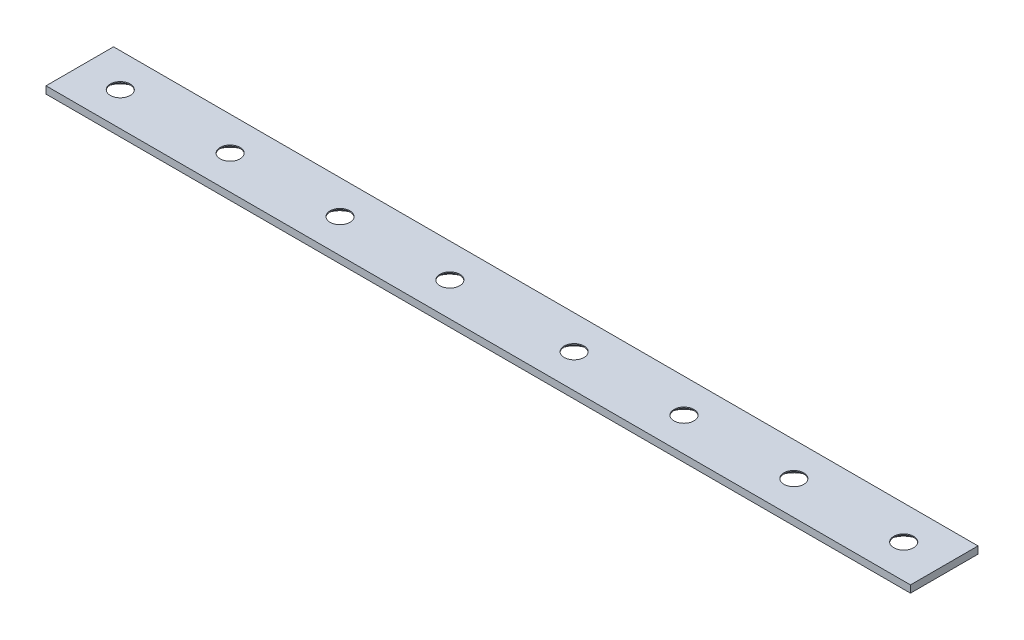
ISO-10303-21;
HEADER;
FILE_DESCRIPTION(('STEP AP214'),'2;1');
FILE_NAME('part.step','',(''),(''),'','','');
FILE_SCHEMA(('AUTOMOTIVE_DESIGN { 1 0 10303 214 1 1 1 1 }'));
ENDSEC;
DATA;
#1=APPLICATION_CONTEXT('core data for automotive mechanical design processes');
#2=APPLICATION_PROTOCOL_DEFINITION('international standard','automotive_design',2000,#1);
#3=PRODUCT_CONTEXT('',#1,'mechanical');
#4=PRODUCT('Part','Part','',(#3));
#5=PRODUCT_RELATED_PRODUCT_CATEGORY('part','',(#4));
#6=PRODUCT_DEFINITION_FORMATION('','',#4);
#7=PRODUCT_DEFINITION_CONTEXT('part definition',#1,'design');
#8=PRODUCT_DEFINITION('design','',#6,#7);
#9=PRODUCT_DEFINITION_SHAPE('','',#8);
#10=(LENGTH_UNIT() NAMED_UNIT(*) SI_UNIT(.MILLI.,.METRE.));
#11=(NAMED_UNIT(*) PLANE_ANGLE_UNIT() SI_UNIT($,.RADIAN.));
#12=(NAMED_UNIT(*) SI_UNIT($,.STERADIAN.) SOLID_ANGLE_UNIT());
#13=UNCERTAINTY_MEASURE_WITH_UNIT(LENGTH_MEASURE(1.E-05),#10,'distance_accuracy_value','');
#14=(GEOMETRIC_REPRESENTATION_CONTEXT(3) GLOBAL_UNCERTAINTY_ASSIGNED_CONTEXT((#13)) GLOBAL_UNIT_ASSIGNED_CONTEXT((#10,
#11,#12)) REPRESENTATION_CONTEXT('',''));
#15=CARTESIAN_POINT('',(0.,0.,0.));
#16=DIRECTION('',(0.,0.,1.));
#17=DIRECTION('',(1.,0.,0.));
#18=AXIS2_PLACEMENT_3D('',#15,#16,#17);
#19=CARTESIAN_POINT('',(0.,2.032,0.));
#20=DIRECTION('',(-1.,0.,0.));
#21=DIRECTION('',(0.,0.,1.));
#22=AXIS2_PLACEMENT_3D('',#19,#20,#21);
#23=PLANE('',#22);
#24=DIRECTION('',(0.,0.,-1.));
#25=VECTOR('',#24,1.);
#26=CARTESIAN_POINT('',(0.,0.,0.));
#27=LINE('',#26,#25);
#28=CARTESIAN_POINT('',(0.,0.,0.));
#29=VERTEX_POINT('',#28);
#30=CARTESIAN_POINT('',(0.,0.,-19.05));
#31=VERTEX_POINT('',#30);
#32=EDGE_CURVE('E102',#29,#31,#27,.T.);
#33=ORIENTED_EDGE('',*,*,#32,.F.);
#34=DIRECTION('',(0.,-1.,0.));
#35=VECTOR('',#34,1.);
#36=CARTESIAN_POINT('',(0.,2.032,0.));
#37=LINE('',#36,#35);
#38=CARTESIAN_POINT('',(0.,2.032,0.));
#39=VERTEX_POINT('',#38);
#40=EDGE_CURVE('E11',#39,#29,#37,.T.);
#41=ORIENTED_EDGE('',*,*,#40,.F.);
#42=DIRECTION('',(0.,0.,-1.));
#43=VECTOR('',#42,1.);
#44=CARTESIAN_POINT('',(0.,2.032,0.));
#45=LINE('',#44,#43);
#46=CARTESIAN_POINT('',(0.,2.032,-19.05));
#47=VERTEX_POINT('',#46);
#48=EDGE_CURVE('E96',#39,#47,#45,.T.);
#49=ORIENTED_EDGE('',*,*,#48,.T.);
#50=DIRECTION('',(0.,-1.,0.));
#51=VECTOR('',#50,1.);
#52=CARTESIAN_POINT('',(0.,2.032,-19.05));
#53=LINE('',#52,#51);
#54=EDGE_CURVE('E39',#47,#31,#53,.T.);
#55=ORIENTED_EDGE('',*,*,#54,.T.);
#56=EDGE_LOOP('',(#33,#41,#49,#55));
#57=FACE_BOUND('',#56,.T.);
#58=ADVANCED_FACE('F36',(#57),#23,.T.);
#59=CARTESIAN_POINT('',(0.,2.032,0.));
#60=DIRECTION('',(0.,0.,-1.));
#61=DIRECTION('',(-1.,0.,0.));
#62=AXIS2_PLACEMENT_3D('',#59,#60,#61);
#63=PLANE('',#62);
#64=DIRECTION('',(1.,0.,0.));
#65=VECTOR('',#64,1.);
#66=CARTESIAN_POINT('',(0.,0.,0.));
#67=LINE('',#66,#65);
#68=CARTESIAN_POINT('',(243.84,0.,0.));
#69=VERTEX_POINT('',#68);
#70=EDGE_CURVE('E69',#29,#69,#67,.T.);
#71=ORIENTED_EDGE('',*,*,#70,.T.);
#72=DIRECTION('',(0.,-1.,0.));
#73=VECTOR('',#72,1.);
#74=CARTESIAN_POINT('',(243.84,2.032,0.));
#75=LINE('',#74,#73);
#76=CARTESIAN_POINT('',(243.84,2.032,0.));
#77=VERTEX_POINT('',#76);
#78=EDGE_CURVE('E45',#77,#69,#75,.T.);
#79=ORIENTED_EDGE('',*,*,#78,.F.);
#80=DIRECTION('',(1.,0.,0.));
#81=VECTOR('',#80,1.);
#82=CARTESIAN_POINT('',(0.,2.032,0.));
#83=LINE('',#82,#81);
#84=EDGE_CURVE('E86',#39,#77,#83,.T.);
#85=ORIENTED_EDGE('',*,*,#84,.F.);
#86=ORIENTED_EDGE('',*,*,#40,.T.);
#87=EDGE_LOOP('',(#71,#79,#85,#86));
#88=FACE_BOUND('',#87,.T.);
#89=ADVANCED_FACE('F113',(#88),#63,.F.);
#90=CARTESIAN_POINT('',(243.84,2.032,0.));
#91=DIRECTION('',(-1.,0.,0.));
#92=DIRECTION('',(0.,0.,1.));
#93=AXIS2_PLACEMENT_3D('',#90,#91,#92);
#94=PLANE('',#93);
#95=DIRECTION('',(0.,0.,-1.));
#96=VECTOR('',#95,1.);
#97=CARTESIAN_POINT('',(243.84,0.,0.));
#98=LINE('',#97,#96);
#99=CARTESIAN_POINT('',(243.84,0.,-19.05));
#100=VERTEX_POINT('',#99);
#101=EDGE_CURVE('E93',#69,#100,#98,.T.);
#102=ORIENTED_EDGE('',*,*,#101,.T.);
#103=DIRECTION('',(0.,-1.,0.));
#104=VECTOR('',#103,1.);
#105=CARTESIAN_POINT('',(243.84,2.032,-19.05));
#106=LINE('',#105,#104);
#107=CARTESIAN_POINT('',(243.84,2.032,-19.05));
#108=VERTEX_POINT('',#107);
#109=EDGE_CURVE('E90',#108,#100,#106,.T.);
#110=ORIENTED_EDGE('',*,*,#109,.F.);
#111=DIRECTION('',(0.,0.,-1.));
#112=VECTOR('',#111,1.);
#113=CARTESIAN_POINT('',(243.84,2.032,0.));
#114=LINE('',#113,#112);
#115=EDGE_CURVE('E81',#77,#108,#114,.T.);
#116=ORIENTED_EDGE('',*,*,#115,.F.);
#117=ORIENTED_EDGE('',*,*,#78,.T.);
#118=EDGE_LOOP('',(#102,#110,#116,#117));
#119=FACE_BOUND('',#118,.T.);
#120=ADVANCED_FACE('F91',(#119),#94,.F.);
#121=CARTESIAN_POINT('',(0.,2.032,-19.05));
#122=DIRECTION('',(0.,0.,-1.));
#123=DIRECTION('',(-1.,0.,0.));
#124=AXIS2_PLACEMENT_3D('',#121,#122,#123);
#125=PLANE('',#124);
#126=DIRECTION('',(1.,0.,0.));
#127=VECTOR('',#126,1.);
#128=CARTESIAN_POINT('',(0.,0.,-19.05));
#129=LINE('',#128,#127);
#130=EDGE_CURVE('E105',#31,#100,#129,.T.);
#131=ORIENTED_EDGE('',*,*,#130,.F.);
#132=ORIENTED_EDGE('',*,*,#54,.F.);
#133=DIRECTION('',(1.,0.,0.));
#134=VECTOR('',#133,1.);
#135=CARTESIAN_POINT('',(0.,2.032,-19.05));
#136=LINE('',#135,#134);
#137=EDGE_CURVE('E85',#47,#108,#136,.T.);
#138=ORIENTED_EDGE('',*,*,#137,.T.);
#139=ORIENTED_EDGE('',*,*,#109,.T.);
#140=EDGE_LOOP('',(#131,#132,#138,#139));
#141=FACE_BOUND('',#140,.T.);
#142=ADVANCED_FACE('F95',(#141),#125,.T.);
#143=CARTESIAN_POINT('',(0.,2.032,0.));
#144=DIRECTION('',(0.,-1.,0.));
#145=DIRECTION('',(0.,0.,-1.));
#146=AXIS2_PLACEMENT_3D('',#143,#144,#145);
#147=PLANE('',#146);
#148=CARTESIAN_POINT('',(11.4300000000001,2.032,-9.52500000000004));
#149=DIRECTION('',(0.,-1.,0.));
#150=DIRECTION('',(0.,0.,-1.));
#151=AXIS2_PLACEMENT_3D('',#148,#149,#150);
#152=CIRCLE('',#151,2.8067);
#153=CARTESIAN_POINT('',(11.4300000000001,2.032,-12.3317));
#154=VERTEX_POINT('',#153);
#155=EDGE_CURVE('E209',#154,#154,#152,.T.);
#156=ORIENTED_EDGE('',*,*,#155,.T.);
#157=EDGE_LOOP('',(#156));
#158=FACE_BOUND('',#157,.T.);
#159=CARTESIAN_POINT('',(42.418,2.032,-9.52500000000004));
#160=DIRECTION('',(0.,-1.,0.));
#161=DIRECTION('',(0.,0.,-1.));
#162=AXIS2_PLACEMENT_3D('',#159,#160,#161);
#163=CIRCLE('',#162,2.8067);
#164=CARTESIAN_POINT('',(42.418,2.032,-12.3317));
#165=VERTEX_POINT('',#164);
#166=EDGE_CURVE('E219',#165,#165,#163,.T.);
#167=ORIENTED_EDGE('',*,*,#166,.T.);
#168=EDGE_LOOP('',(#167));
#169=FACE_BOUND('',#168,.T.);
#170=CARTESIAN_POINT('',(73.406,2.032,-9.52500000000004));
#171=DIRECTION('',(0.,-1.,0.));
#172=DIRECTION('',(0.,0.,-1.));
#173=AXIS2_PLACEMENT_3D('',#170,#171,#172);
#174=CIRCLE('',#173,2.8067);
#175=CARTESIAN_POINT('',(73.406,2.032,-12.3317));
#176=VERTEX_POINT('',#175);
#177=EDGE_CURVE('E228',#176,#176,#174,.T.);
#178=ORIENTED_EDGE('',*,*,#177,.T.);
#179=EDGE_LOOP('',(#178));
#180=FACE_BOUND('',#179,.T.);
#181=CARTESIAN_POINT('',(104.394,2.032,-9.52500000000004));
#182=DIRECTION('',(0.,-1.,0.));
#183=DIRECTION('',(0.,0.,-1.));
#184=AXIS2_PLACEMENT_3D('',#181,#182,#183);
#185=CIRCLE('',#184,2.8067);
#186=CARTESIAN_POINT('',(104.394,2.032,-12.3317));
#187=VERTEX_POINT('',#186);
#188=EDGE_CURVE('E237',#187,#187,#185,.T.);
#189=ORIENTED_EDGE('',*,*,#188,.T.);
#190=EDGE_LOOP('',(#189));
#191=FACE_BOUND('',#190,.T.);
#192=CARTESIAN_POINT('',(139.446,2.032,-9.52500000000004));
#193=DIRECTION('',(0.,-1.,0.));
#194=DIRECTION('',(0.,0.,-1.));
#195=AXIS2_PLACEMENT_3D('',#192,#193,#194);
#196=CIRCLE('',#195,2.8067);
#197=CARTESIAN_POINT('',(139.446,2.032,-12.3317));
#198=VERTEX_POINT('',#197);
#199=EDGE_CURVE('E246',#198,#198,#196,.T.);
#200=ORIENTED_EDGE('',*,*,#199,.T.);
#201=EDGE_LOOP('',(#200));
#202=FACE_BOUND('',#201,.T.);
#203=CARTESIAN_POINT('',(170.434,2.032,-9.52500000000004));
#204=DIRECTION('',(0.,-1.,0.));
#205=DIRECTION('',(0.,0.,-1.));
#206=AXIS2_PLACEMENT_3D('',#203,#204,#205);
#207=CIRCLE('',#206,2.8067);
#208=CARTESIAN_POINT('',(170.434,2.032,-12.3317));
#209=VERTEX_POINT('',#208);
#210=EDGE_CURVE('E255',#209,#209,#207,.T.);
#211=ORIENTED_EDGE('',*,*,#210,.T.);
#212=EDGE_LOOP('',(#211));
#213=FACE_BOUND('',#212,.T.);
#214=CARTESIAN_POINT('',(201.422,2.032,-9.52500000000004));
#215=DIRECTION('',(0.,-1.,0.));
#216=DIRECTION('',(0.,0.,-1.));
#217=AXIS2_PLACEMENT_3D('',#214,#215,#216);
#218=CIRCLE('',#217,2.8067);
#219=CARTESIAN_POINT('',(201.422,2.032,-12.3317));
#220=VERTEX_POINT('',#219);
#221=EDGE_CURVE('E264',#220,#220,#218,.T.);
#222=ORIENTED_EDGE('',*,*,#221,.T.);
#223=EDGE_LOOP('',(#222));
#224=FACE_BOUND('',#223,.T.);
#225=CARTESIAN_POINT('',(232.41,2.032,-9.52500000000004));
#226=DIRECTION('',(0.,-1.,0.));
#227=DIRECTION('',(0.,0.,-1.));
#228=AXIS2_PLACEMENT_3D('',#225,#226,#227);
#229=CIRCLE('',#228,2.8067);
#230=CARTESIAN_POINT('',(232.41,2.032,-12.3317));
#231=VERTEX_POINT('',#230);
#232=EDGE_CURVE('E106',#231,#231,#229,.T.);
#233=ORIENTED_EDGE('',*,*,#232,.T.);
#234=EDGE_LOOP('',(#233));
#235=FACE_BOUND('',#234,.T.);
#236=ORIENTED_EDGE('',*,*,#48,.F.);
#237=ORIENTED_EDGE('',*,*,#84,.T.);
#238=ORIENTED_EDGE('',*,*,#115,.T.);
#239=ORIENTED_EDGE('',*,*,#137,.F.);
#240=EDGE_LOOP('',(#236,#237,#238,#239));
#241=FACE_BOUND('',#240,.T.);
#242=ADVANCED_FACE('F84',(#158,#169,#180,#191,#202,#213,#224,#235,#241),#147,.F.);
#243=CARTESIAN_POINT('',(0.,0.,0.));
#244=DIRECTION('',(0.,-1.,0.));
#245=DIRECTION('',(0.,0.,-1.));
#246=AXIS2_PLACEMENT_3D('',#243,#244,#245);
#247=PLANE('',#246);
#248=CARTESIAN_POINT('',(11.4300000000001,0.,-9.52500000000004));
#249=DIRECTION('',(0.,-1.,0.));
#250=DIRECTION('',(0.,0.,-1.));
#251=AXIS2_PLACEMENT_3D('',#248,#249,#250);
#252=CIRCLE('',#251,4.8895);
#253=CARTESIAN_POINT('',(11.4300000000001,0.,-14.4145));
#254=VERTEX_POINT('',#253);
#255=EDGE_CURVE('E207',#254,#254,#252,.T.);
#256=ORIENTED_EDGE('',*,*,#255,.F.);
#257=EDGE_LOOP('',(#256));
#258=FACE_BOUND('',#257,.T.);
#259=CARTESIAN_POINT('',(42.418,0.,-9.52500000000004));
#260=DIRECTION('',(0.,-1.,0.));
#261=DIRECTION('',(0.,0.,-1.));
#262=AXIS2_PLACEMENT_3D('',#259,#260,#261);
#263=CIRCLE('',#262,4.8895);
#264=CARTESIAN_POINT('',(42.418,0.,-14.4145));
#265=VERTEX_POINT('',#264);
#266=EDGE_CURVE('E213',#265,#265,#263,.T.);
#267=ORIENTED_EDGE('',*,*,#266,.F.);
#268=EDGE_LOOP('',(#267));
#269=FACE_BOUND('',#268,.T.);
#270=CARTESIAN_POINT('',(73.406,0.,-9.52500000000004));
#271=DIRECTION('',(0.,-1.,0.));
#272=DIRECTION('',(0.,0.,-1.));
#273=AXIS2_PLACEMENT_3D('',#270,#271,#272);
#274=CIRCLE('',#273,4.88950000000001);
#275=CARTESIAN_POINT('',(73.406,0.,-14.4145));
#276=VERTEX_POINT('',#275);
#277=EDGE_CURVE('E222',#276,#276,#274,.T.);
#278=ORIENTED_EDGE('',*,*,#277,.F.);
#279=EDGE_LOOP('',(#278));
#280=FACE_BOUND('',#279,.T.);
#281=CARTESIAN_POINT('',(104.394,0.,-9.52500000000004));
#282=DIRECTION('',(0.,-1.,0.));
#283=DIRECTION('',(0.,0.,-1.));
#284=AXIS2_PLACEMENT_3D('',#281,#282,#283);
#285=CIRCLE('',#284,4.88950000000001);
#286=CARTESIAN_POINT('',(104.394,0.,-14.4145));
#287=VERTEX_POINT('',#286);
#288=EDGE_CURVE('E231',#287,#287,#285,.T.);
#289=ORIENTED_EDGE('',*,*,#288,.F.);
#290=EDGE_LOOP('',(#289));
#291=FACE_BOUND('',#290,.T.);
#292=CARTESIAN_POINT('',(139.446,0.,-9.52500000000004));
#293=DIRECTION('',(0.,-1.,0.));
#294=DIRECTION('',(0.,0.,-1.));
#295=AXIS2_PLACEMENT_3D('',#292,#293,#294);
#296=CIRCLE('',#295,4.88949999999999);
#297=CARTESIAN_POINT('',(139.446,0.,-14.4145));
#298=VERTEX_POINT('',#297);
#299=EDGE_CURVE('E240',#298,#298,#296,.T.);
#300=ORIENTED_EDGE('',*,*,#299,.F.);
#301=EDGE_LOOP('',(#300));
#302=FACE_BOUND('',#301,.T.);
#303=CARTESIAN_POINT('',(170.434,0.,-9.52500000000004));
#304=DIRECTION('',(0.,-1.,0.));
#305=DIRECTION('',(0.,0.,-1.));
#306=AXIS2_PLACEMENT_3D('',#303,#304,#305);
#307=CIRCLE('',#306,4.88949999999999);
#308=CARTESIAN_POINT('',(170.434,0.,-14.4145));
#309=VERTEX_POINT('',#308);
#310=EDGE_CURVE('E249',#309,#309,#307,.T.);
#311=ORIENTED_EDGE('',*,*,#310,.F.);
#312=EDGE_LOOP('',(#311));
#313=FACE_BOUND('',#312,.T.);
#314=CARTESIAN_POINT('',(201.422,0.,-9.52500000000004));
#315=DIRECTION('',(0.,-1.,0.));
#316=DIRECTION('',(0.,0.,-1.));
#317=AXIS2_PLACEMENT_3D('',#314,#315,#316);
#318=CIRCLE('',#317,4.88949999999999);
#319=CARTESIAN_POINT('',(201.422,0.,-14.4145));
#320=VERTEX_POINT('',#319);
#321=EDGE_CURVE('E258',#320,#320,#318,.T.);
#322=ORIENTED_EDGE('',*,*,#321,.F.);
#323=EDGE_LOOP('',(#322));
#324=FACE_BOUND('',#323,.T.);
#325=CARTESIAN_POINT('',(232.41,0.,-9.52500000000004));
#326=DIRECTION('',(0.,-1.,0.));
#327=DIRECTION('',(0.,0.,-1.));
#328=AXIS2_PLACEMENT_3D('',#325,#326,#327);
#329=CIRCLE('',#328,4.88949999999999);
#330=CARTESIAN_POINT('',(232.41,0.,-14.4145));
#331=VERTEX_POINT('',#330);
#332=EDGE_CURVE('E267',#331,#331,#329,.T.);
#333=ORIENTED_EDGE('',*,*,#332,.F.);
#334=EDGE_LOOP('',(#333));
#335=FACE_BOUND('',#334,.T.);
#336=ORIENTED_EDGE('',*,*,#32,.T.);
#337=ORIENTED_EDGE('',*,*,#130,.T.);
#338=ORIENTED_EDGE('',*,*,#101,.F.);
#339=ORIENTED_EDGE('',*,*,#70,.F.);
#340=EDGE_LOOP('',(#336,#337,#338,#339));
#341=FACE_BOUND('',#340,.T.);
#342=ADVANCED_FACE('F111',(#258,#269,#280,#291,#302,#313,#324,#335,#341),#247,.T.);
#343=CARTESIAN_POINT('',(232.41,0.,-9.52500000000004));
#344=DIRECTION('',(0.,-1.,0.));
#345=DIRECTION('',(0.,0.,-1.));
#346=AXIS2_PLACEMENT_3D('',#343,#344,#345);
#347=CYLINDRICAL_SURFACE('',#346,2.8067);
#348=ORIENTED_EDGE('',*,*,#232,.F.);
#349=EDGE_LOOP('',(#348));
#350=FACE_BOUND('',#349,.T.);
#351=CARTESIAN_POINT('',(232.41,1.74767671181604,-9.52500000000004));
#352=DIRECTION('',(0.,-1.,0.));
#353=DIRECTION('',(0.,0.,-1.));
#354=AXIS2_PLACEMENT_3D('',#351,#352,#353);
#355=CIRCLE('',#354,2.8067);
#356=CARTESIAN_POINT('',(232.41,1.74767671181604,-12.3317));
#357=VERTEX_POINT('',#356);
#358=EDGE_CURVE('E270',#357,#357,#355,.T.);
#359=ORIENTED_EDGE('',*,*,#358,.T.);
#360=EDGE_LOOP('',(#359));
#361=FACE_BOUND('',#360,.T.);
#362=ADVANCED_FACE('F132',(#350,#361),#347,.F.);
#363=CARTESIAN_POINT('',(232.41,0.,-9.52500000000004));
#364=DIRECTION('',(0.,-1.,0.));
#365=DIRECTION('',(0.,0.,-1.));
#366=AXIS2_PLACEMENT_3D('',#363,#364,#365);
#367=CONICAL_SURFACE('',#366,4.88949999999999,0.872664625997164);
#368=ORIENTED_EDGE('',*,*,#358,.F.);
#369=EDGE_LOOP('',(#368));
#370=FACE_BOUND('',#369,.T.);
#371=ORIENTED_EDGE('',*,*,#332,.T.);
#372=EDGE_LOOP('',(#371));
#373=FACE_BOUND('',#372,.T.);
#374=ADVANCED_FACE('F139',(#370,#373),#367,.F.);
#375=CARTESIAN_POINT('',(201.422,0.,-9.52500000000004));
#376=DIRECTION('',(0.,-1.,0.));
#377=DIRECTION('',(0.,0.,-1.));
#378=AXIS2_PLACEMENT_3D('',#375,#376,#377);
#379=CYLINDRICAL_SURFACE('',#378,2.8067);
#380=ORIENTED_EDGE('',*,*,#221,.F.);
#381=EDGE_LOOP('',(#380));
#382=FACE_BOUND('',#381,.T.);
#383=CARTESIAN_POINT('',(201.422,1.74767671181604,-9.52500000000004));
#384=DIRECTION('',(0.,-1.,0.));
#385=DIRECTION('',(0.,0.,-1.));
#386=AXIS2_PLACEMENT_3D('',#383,#384,#385);
#387=CIRCLE('',#386,2.8067);
#388=CARTESIAN_POINT('',(201.422,1.74767671181604,-12.3317));
#389=VERTEX_POINT('',#388);
#390=EDGE_CURVE('E261',#389,#389,#387,.T.);
#391=ORIENTED_EDGE('',*,*,#390,.T.);
#392=EDGE_LOOP('',(#391));
#393=FACE_BOUND('',#392,.T.);
#394=ADVANCED_FACE('F143',(#382,#393),#379,.F.);
#395=CARTESIAN_POINT('',(201.422,0.,-9.52500000000004));
#396=DIRECTION('',(0.,-1.,0.));
#397=DIRECTION('',(0.,0.,-1.));
#398=AXIS2_PLACEMENT_3D('',#395,#396,#397);
#399=CONICAL_SURFACE('',#398,4.88949999999999,0.872664625997164);
#400=ORIENTED_EDGE('',*,*,#390,.F.);
#401=EDGE_LOOP('',(#400));
#402=FACE_BOUND('',#401,.T.);
#403=ORIENTED_EDGE('',*,*,#321,.T.);
#404=EDGE_LOOP('',(#403));
#405=FACE_BOUND('',#404,.T.);
#406=ADVANCED_FACE('F147',(#402,#405),#399,.F.);
#407=CARTESIAN_POINT('',(170.434,0.,-9.52500000000004));
#408=DIRECTION('',(0.,-1.,0.));
#409=DIRECTION('',(0.,0.,-1.));
#410=AXIS2_PLACEMENT_3D('',#407,#408,#409);
#411=CYLINDRICAL_SURFACE('',#410,2.8067);
#412=ORIENTED_EDGE('',*,*,#210,.F.);
#413=EDGE_LOOP('',(#412));
#414=FACE_BOUND('',#413,.T.);
#415=CARTESIAN_POINT('',(170.434,1.74767671181604,-9.52500000000004));
#416=DIRECTION('',(0.,-1.,0.));
#417=DIRECTION('',(0.,0.,-1.));
#418=AXIS2_PLACEMENT_3D('',#415,#416,#417);
#419=CIRCLE('',#418,2.8067);
#420=CARTESIAN_POINT('',(170.434,1.74767671181604,-12.3317));
#421=VERTEX_POINT('',#420);
#422=EDGE_CURVE('E252',#421,#421,#419,.T.);
#423=ORIENTED_EDGE('',*,*,#422,.T.);
#424=EDGE_LOOP('',(#423));
#425=FACE_BOUND('',#424,.T.);
#426=ADVANCED_FACE('F151',(#414,#425),#411,.F.);
#427=CARTESIAN_POINT('',(170.434,0.,-9.52500000000004));
#428=DIRECTION('',(0.,-1.,0.));
#429=DIRECTION('',(0.,0.,-1.));
#430=AXIS2_PLACEMENT_3D('',#427,#428,#429);
#431=CONICAL_SURFACE('',#430,4.88949999999999,0.872664625997164);
#432=ORIENTED_EDGE('',*,*,#422,.F.);
#433=EDGE_LOOP('',(#432));
#434=FACE_BOUND('',#433,.T.);
#435=ORIENTED_EDGE('',*,*,#310,.T.);
#436=EDGE_LOOP('',(#435));
#437=FACE_BOUND('',#436,.T.);
#438=ADVANCED_FACE('F155',(#434,#437),#431,.F.);
#439=CARTESIAN_POINT('',(139.446,0.,-9.52500000000004));
#440=DIRECTION('',(0.,-1.,0.));
#441=DIRECTION('',(0.,0.,-1.));
#442=AXIS2_PLACEMENT_3D('',#439,#440,#441);
#443=CYLINDRICAL_SURFACE('',#442,2.8067);
#444=ORIENTED_EDGE('',*,*,#199,.F.);
#445=EDGE_LOOP('',(#444));
#446=FACE_BOUND('',#445,.T.);
#447=CARTESIAN_POINT('',(139.446,1.74767671181604,-9.52500000000004));
#448=DIRECTION('',(0.,-1.,0.));
#449=DIRECTION('',(0.,0.,-1.));
#450=AXIS2_PLACEMENT_3D('',#447,#448,#449);
#451=CIRCLE('',#450,2.8067);
#452=CARTESIAN_POINT('',(139.446,1.74767671181604,-12.3317));
#453=VERTEX_POINT('',#452);
#454=EDGE_CURVE('E243',#453,#453,#451,.T.);
#455=ORIENTED_EDGE('',*,*,#454,.T.);
#456=EDGE_LOOP('',(#455));
#457=FACE_BOUND('',#456,.T.);
#458=ADVANCED_FACE('F159',(#446,#457),#443,.F.);
#459=CARTESIAN_POINT('',(139.446,0.,-9.52500000000004));
#460=DIRECTION('',(0.,-1.,0.));
#461=DIRECTION('',(0.,0.,-1.));
#462=AXIS2_PLACEMENT_3D('',#459,#460,#461);
#463=CONICAL_SURFACE('',#462,4.88949999999999,0.872664625997164);
#464=ORIENTED_EDGE('',*,*,#454,.F.);
#465=EDGE_LOOP('',(#464));
#466=FACE_BOUND('',#465,.T.);
#467=ORIENTED_EDGE('',*,*,#299,.T.);
#468=EDGE_LOOP('',(#467));
#469=FACE_BOUND('',#468,.T.);
#470=ADVANCED_FACE('F163',(#466,#469),#463,.F.);
#471=CARTESIAN_POINT('',(104.394,0.,-9.52500000000004));
#472=DIRECTION('',(0.,-1.,0.));
#473=DIRECTION('',(0.,0.,-1.));
#474=AXIS2_PLACEMENT_3D('',#471,#472,#473);
#475=CYLINDRICAL_SURFACE('',#474,2.8067);
#476=ORIENTED_EDGE('',*,*,#188,.F.);
#477=EDGE_LOOP('',(#476));
#478=FACE_BOUND('',#477,.T.);
#479=CARTESIAN_POINT('',(104.394,1.74767671181604,-9.52500000000004));
#480=DIRECTION('',(0.,-1.,0.));
#481=DIRECTION('',(0.,0.,-1.));
#482=AXIS2_PLACEMENT_3D('',#479,#480,#481);
#483=CIRCLE('',#482,2.8067);
#484=CARTESIAN_POINT('',(104.394,1.74767671181604,-12.3317));
#485=VERTEX_POINT('',#484);
#486=EDGE_CURVE('E234',#485,#485,#483,.T.);
#487=ORIENTED_EDGE('',*,*,#486,.T.);
#488=EDGE_LOOP('',(#487));
#489=FACE_BOUND('',#488,.T.);
#490=ADVANCED_FACE('F167',(#478,#489),#475,.F.);
#491=CARTESIAN_POINT('',(104.394,0.,-9.52500000000004));
#492=DIRECTION('',(0.,-1.,0.));
#493=DIRECTION('',(0.,0.,-1.));
#494=AXIS2_PLACEMENT_3D('',#491,#492,#493);
#495=CONICAL_SURFACE('',#494,4.88950000000001,0.872664625997167);
#496=ORIENTED_EDGE('',*,*,#486,.F.);
#497=EDGE_LOOP('',(#496));
#498=FACE_BOUND('',#497,.T.);
#499=ORIENTED_EDGE('',*,*,#288,.T.);
#500=EDGE_LOOP('',(#499));
#501=FACE_BOUND('',#500,.T.);
#502=ADVANCED_FACE('F171',(#498,#501),#495,.F.);
#503=CARTESIAN_POINT('',(73.406,0.,-9.52500000000004));
#504=DIRECTION('',(0.,-1.,0.));
#505=DIRECTION('',(0.,0.,-1.));
#506=AXIS2_PLACEMENT_3D('',#503,#504,#505);
#507=CYLINDRICAL_SURFACE('',#506,2.8067);
#508=ORIENTED_EDGE('',*,*,#177,.F.);
#509=EDGE_LOOP('',(#508));
#510=FACE_BOUND('',#509,.T.);
#511=CARTESIAN_POINT('',(73.406,1.74767671181604,-9.52500000000004));
#512=DIRECTION('',(0.,-1.,0.));
#513=DIRECTION('',(0.,0.,-1.));
#514=AXIS2_PLACEMENT_3D('',#511,#512,#513);
#515=CIRCLE('',#514,2.8067);
#516=CARTESIAN_POINT('',(73.406,1.74767671181604,-12.3317));
#517=VERTEX_POINT('',#516);
#518=EDGE_CURVE('E225',#517,#517,#515,.T.);
#519=ORIENTED_EDGE('',*,*,#518,.T.);
#520=EDGE_LOOP('',(#519));
#521=FACE_BOUND('',#520,.T.);
#522=ADVANCED_FACE('F175',(#510,#521),#507,.F.);
#523=CARTESIAN_POINT('',(73.406,0.,-9.52500000000004));
#524=DIRECTION('',(0.,-1.,0.));
#525=DIRECTION('',(0.,0.,-1.));
#526=AXIS2_PLACEMENT_3D('',#523,#524,#525);
#527=CONICAL_SURFACE('',#526,4.88950000000001,0.872664625997167);
#528=ORIENTED_EDGE('',*,*,#518,.F.);
#529=EDGE_LOOP('',(#528));
#530=FACE_BOUND('',#529,.T.);
#531=ORIENTED_EDGE('',*,*,#277,.T.);
#532=EDGE_LOOP('',(#531));
#533=FACE_BOUND('',#532,.T.);
#534=ADVANCED_FACE('F179',(#530,#533),#527,.F.);
#535=CARTESIAN_POINT('',(42.418,0.,-9.52500000000004));
#536=DIRECTION('',(0.,-1.,0.));
#537=DIRECTION('',(0.,0.,-1.));
#538=AXIS2_PLACEMENT_3D('',#535,#536,#537);
#539=CYLINDRICAL_SURFACE('',#538,2.8067);
#540=ORIENTED_EDGE('',*,*,#166,.F.);
#541=EDGE_LOOP('',(#540));
#542=FACE_BOUND('',#541,.T.);
#543=CARTESIAN_POINT('',(42.418,1.74767671181604,-9.52500000000004));
#544=DIRECTION('',(0.,-1.,0.));
#545=DIRECTION('',(0.,0.,-1.));
#546=AXIS2_PLACEMENT_3D('',#543,#544,#545);
#547=CIRCLE('',#546,2.8067);
#548=CARTESIAN_POINT('',(42.418,1.74767671181604,-12.3317));
#549=VERTEX_POINT('',#548);
#550=EDGE_CURVE('E216',#549,#549,#547,.T.);
#551=ORIENTED_EDGE('',*,*,#550,.T.);
#552=EDGE_LOOP('',(#551));
#553=FACE_BOUND('',#552,.T.);
#554=ADVANCED_FACE('F183',(#542,#553),#539,.F.);
#555=CARTESIAN_POINT('',(42.418,0.,-9.52500000000004));
#556=DIRECTION('',(0.,-1.,0.));
#557=DIRECTION('',(0.,0.,-1.));
#558=AXIS2_PLACEMENT_3D('',#555,#556,#557);
#559=CONICAL_SURFACE('',#558,4.8895,0.872664625997164);
#560=ORIENTED_EDGE('',*,*,#550,.F.);
#561=EDGE_LOOP('',(#560));
#562=FACE_BOUND('',#561,.T.);
#563=ORIENTED_EDGE('',*,*,#266,.T.);
#564=EDGE_LOOP('',(#563));
#565=FACE_BOUND('',#564,.T.);
#566=ADVANCED_FACE('F187',(#562,#565),#559,.F.);
#567=CARTESIAN_POINT('',(11.4300000000001,0.,-9.52500000000004));
#568=DIRECTION('',(0.,-1.,0.));
#569=DIRECTION('',(0.,0.,-1.));
#570=AXIS2_PLACEMENT_3D('',#567,#568,#569);
#571=CYLINDRICAL_SURFACE('',#570,2.8067);
#572=ORIENTED_EDGE('',*,*,#155,.F.);
#573=EDGE_LOOP('',(#572));
#574=FACE_BOUND('',#573,.T.);
#575=CARTESIAN_POINT('',(11.4300000000001,1.74767671181604,-9.52500000000004));
#576=DIRECTION('',(0.,-1.,0.));
#577=DIRECTION('',(0.,0.,-1.));
#578=AXIS2_PLACEMENT_3D('',#575,#576,#577);
#579=CIRCLE('',#578,2.8067);
#580=CARTESIAN_POINT('',(11.4300000000001,1.74767671181604,-12.3317));
#581=VERTEX_POINT('',#580);
#582=EDGE_CURVE('E204',#581,#581,#579,.T.);
#583=ORIENTED_EDGE('',*,*,#582,.T.);
#584=EDGE_LOOP('',(#583));
#585=FACE_BOUND('',#584,.T.);
#586=ADVANCED_FACE('F191',(#574,#585),#571,.F.);
#587=CARTESIAN_POINT('',(11.4300000000001,0.,-9.52500000000004));
#588=DIRECTION('',(0.,-1.,0.));
#589=DIRECTION('',(0.,0.,-1.));
#590=AXIS2_PLACEMENT_3D('',#587,#588,#589);
#591=CONICAL_SURFACE('',#590,4.8895,0.872664625997164);
#592=ORIENTED_EDGE('',*,*,#582,.F.);
#593=EDGE_LOOP('',(#592));
#594=FACE_BOUND('',#593,.T.);
#595=ORIENTED_EDGE('',*,*,#255,.T.);
#596=EDGE_LOOP('',(#595));
#597=FACE_BOUND('',#596,.T.);
#598=ADVANCED_FACE('F195',(#594,#597),#591,.F.);
#599=CLOSED_SHELL('',(#58,#89,#120,#142,#242,#342,#362,#374,#394,#406,#426,#438,#458,#470,#490,
#502,#522,#534,#554,#566,#586,#598));
#600=MANIFOLD_SOLID_BREP('B2',#599);
#601=ADVANCED_BREP_SHAPE_REPRESENTATION('',(#18,#600),#14);
#602=SHAPE_DEFINITION_REPRESENTATION(#9,#601);
ENDSEC;
END-ISO-10303-21;
